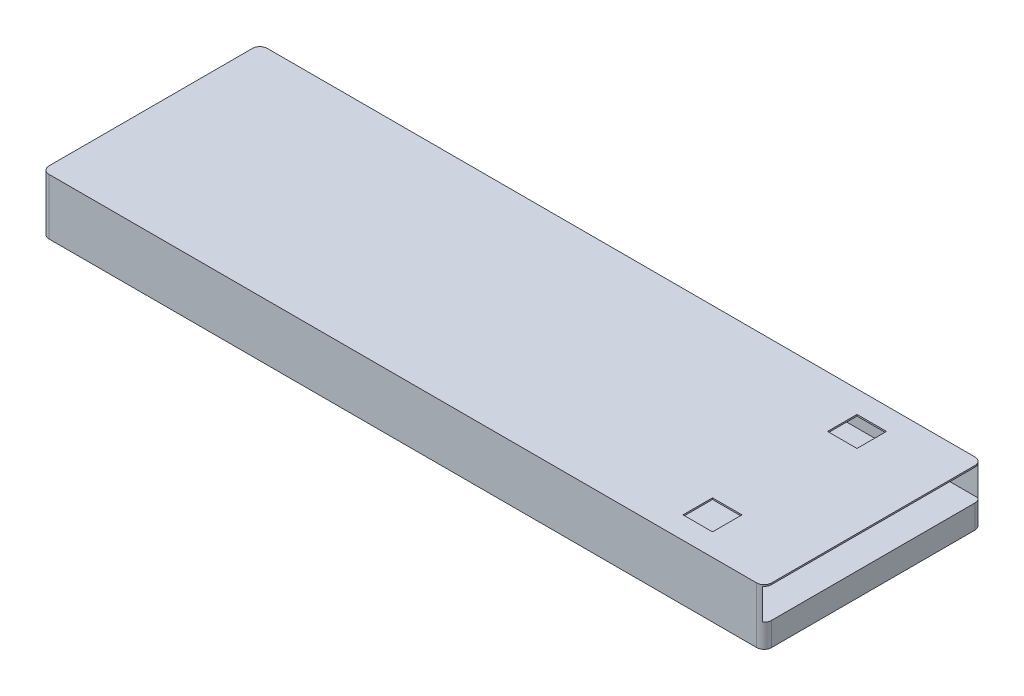
ISO-10303-21;
HEADER;
FILE_DESCRIPTION(('STEP AP214'),'2;1');
FILE_NAME('part.step','',(''),(''),'','','');
FILE_SCHEMA(('AUTOMOTIVE_DESIGN { 1 0 10303 214 1 1 1 1 }'));
ENDSEC;
DATA;
#1=APPLICATION_CONTEXT('core data for automotive mechanical design processes');
#2=APPLICATION_PROTOCOL_DEFINITION('international standard','automotive_design',2000,#1);
#3=PRODUCT_CONTEXT('',#1,'mechanical');
#4=PRODUCT('Part','Part','',(#3));
#5=PRODUCT_RELATED_PRODUCT_CATEGORY('part','',(#4));
#6=PRODUCT_DEFINITION_FORMATION('','',#4);
#7=PRODUCT_DEFINITION_CONTEXT('part definition',#1,'design');
#8=PRODUCT_DEFINITION('design','',#6,#7);
#9=PRODUCT_DEFINITION_SHAPE('','',#8);
#10=(LENGTH_UNIT() NAMED_UNIT(*) SI_UNIT(.MILLI.,.METRE.));
#11=(NAMED_UNIT(*) PLANE_ANGLE_UNIT() SI_UNIT($,.RADIAN.));
#12=(NAMED_UNIT(*) SI_UNIT($,.STERADIAN.) SOLID_ANGLE_UNIT());
#13=UNCERTAINTY_MEASURE_WITH_UNIT(LENGTH_MEASURE(1.E-05),#10,'distance_accuracy_value','');
#14=(GEOMETRIC_REPRESENTATION_CONTEXT(3) GLOBAL_UNCERTAINTY_ASSIGNED_CONTEXT((#13)) GLOBAL_UNIT_ASSIGNED_CONTEXT((#10,
#11,#12)) REPRESENTATION_CONTEXT('',''));
#15=CARTESIAN_POINT('',(0.,0.,0.));
#16=DIRECTION('',(0.,0.,1.));
#17=DIRECTION('',(1.,0.,0.));
#18=AXIS2_PLACEMENT_3D('',#15,#16,#17);
#19=CARTESIAN_POINT('',(0.,-3.8,0.));
#20=DIRECTION('',(0.,1.,0.));
#21=DIRECTION('',(0.,0.,1.));
#22=AXIS2_PLACEMENT_3D('',#19,#20,#21);
#23=PLANE('',#22);
#24=DIRECTION('',(0.,0.,-1.));
#25=VECTOR('',#24,1.);
#26=CARTESIAN_POINT('',(0.,-3.8,0.));
#27=LINE('',#26,#25);
#28=CARTESIAN_POINT('',(0.,-3.8,-0.5));
#29=VERTEX_POINT('',#28);
#30=CARTESIAN_POINT('',(0.,-3.8,-14.3));
#31=VERTEX_POINT('',#30);
#32=EDGE_CURVE('E344',#29,#31,#27,.T.);
#33=ORIENTED_EDGE('',*,*,#32,.F.);
#34=CARTESIAN_POINT('',(-0.5,-3.8,-0.5));
#35=DIRECTION('',(0.,1.,0.));
#36=DIRECTION('',(0.,0.,1.));
#37=AXIS2_PLACEMENT_3D('',#34,#35,#36);
#38=CIRCLE('',#37,0.5);
#39=CARTESIAN_POINT('',(-0.5,-3.8,0.));
#40=VERTEX_POINT('',#39);
#41=EDGE_CURVE('E405',#29,#40,#38,.F.);
#42=ORIENTED_EDGE('',*,*,#41,.T.);
#43=DIRECTION('',(1.,0.,0.));
#44=VECTOR('',#43,1.);
#45=CARTESIAN_POINT('',(0.,-3.8,0.));
#46=LINE('',#45,#44);
#47=CARTESIAN_POINT('',(-48.5,-3.8,0.));
#48=VERTEX_POINT('',#47);
#49=EDGE_CURVE('E354',#48,#40,#46,.T.);
#50=ORIENTED_EDGE('',*,*,#49,.F.);
#51=CARTESIAN_POINT('',(-48.5,-3.8,-0.499999999999994));
#52=DIRECTION('',(0.,1.,0.));
#53=DIRECTION('',(0.,0.,1.));
#54=AXIS2_PLACEMENT_3D('',#51,#52,#53);
#55=CIRCLE('',#54,0.5);
#56=CARTESIAN_POINT('',(-49.,-3.8,-0.499999999999994));
#57=VERTEX_POINT('',#56);
#58=EDGE_CURVE('E399',#48,#57,#55,.F.);
#59=ORIENTED_EDGE('',*,*,#58,.T.);
#60=DIRECTION('',(0.,0.,1.));
#61=VECTOR('',#60,1.);
#62=CARTESIAN_POINT('',(-49.,-3.8,0.));
#63=LINE('',#62,#61);
#64=CARTESIAN_POINT('',(-49.,-3.8,-14.3));
#65=VERTEX_POINT('',#64);
#66=EDGE_CURVE('E351',#65,#57,#63,.T.);
#67=ORIENTED_EDGE('',*,*,#66,.F.);
#68=CARTESIAN_POINT('',(-48.5,-3.8,-14.3));
#69=DIRECTION('',(0.,1.,0.));
#70=DIRECTION('',(0.,0.,1.));
#71=AXIS2_PLACEMENT_3D('',#68,#69,#70);
#72=CIRCLE('',#71,0.5);
#73=CARTESIAN_POINT('',(-48.5,-3.8,-14.8));
#74=VERTEX_POINT('',#73);
#75=EDGE_CURVE('E401',#65,#74,#72,.F.);
#76=ORIENTED_EDGE('',*,*,#75,.T.);
#77=DIRECTION('',(-1.,0.,0.));
#78=VECTOR('',#77,1.);
#79=CARTESIAN_POINT('',(0.,-3.8,-14.8));
#80=LINE('',#79,#78);
#81=CARTESIAN_POINT('',(-0.5,-3.8,-14.8));
#82=VERTEX_POINT('',#81);
#83=EDGE_CURVE('E347',#82,#74,#80,.T.);
#84=ORIENTED_EDGE('',*,*,#83,.F.);
#85=CARTESIAN_POINT('',(-0.5,-3.8,-14.3));
#86=DIRECTION('',(0.,1.,0.));
#87=DIRECTION('',(0.,0.,1.));
#88=AXIS2_PLACEMENT_3D('',#85,#86,#87);
#89=CIRCLE('',#88,0.5);
#90=EDGE_CURVE('E403',#82,#31,#89,.F.);
#91=ORIENTED_EDGE('',*,*,#90,.T.);
#92=EDGE_LOOP('',(#33,#42,#50,#59,#67,#76,#84,#91));
#93=FACE_BOUND('',#92,.T.);
#94=DIRECTION('',(0.,0.,-1.));
#95=VECTOR('',#94,1.);
#96=CARTESIAN_POINT('',(-34.,-3.8,-3.9));
#97=LINE('',#96,#95);
#98=CARTESIAN_POINT('',(-34.,-3.8,-3.9));
#99=VERTEX_POINT('',#98);
#100=CARTESIAN_POINT('',(-34.,-3.8,-10.9));
#101=VERTEX_POINT('',#100);
#102=EDGE_CURVE('E224',#99,#101,#97,.T.);
#103=ORIENTED_EDGE('',*,*,#102,.F.);
#104=DIRECTION('',(-1.,0.,0.));
#105=VECTOR('',#104,1.);
#106=CARTESIAN_POINT('',(-34.,-3.8,-3.9));
#107=LINE('',#106,#105);
#108=CARTESIAN_POINT('',(-25.,-3.8,-3.9));
#109=VERTEX_POINT('',#108);
#110=EDGE_CURVE('E231',#109,#99,#107,.T.);
#111=ORIENTED_EDGE('',*,*,#110,.F.);
#112=DIRECTION('',(0.,0.,1.));
#113=VECTOR('',#112,1.);
#114=CARTESIAN_POINT('',(-25.,-3.8,-3.9));
#115=LINE('',#114,#113);
#116=CARTESIAN_POINT('',(-25.,-3.8,-10.9));
#117=VERTEX_POINT('',#116);
#118=EDGE_CURVE('E242',#117,#109,#115,.T.);
#119=ORIENTED_EDGE('',*,*,#118,.F.);
#120=DIRECTION('',(1.,0.,0.));
#121=VECTOR('',#120,1.);
#122=CARTESIAN_POINT('',(-34.,-3.8,-10.9));
#123=LINE('',#122,#121);
#124=EDGE_CURVE('E239',#101,#117,#123,.T.);
#125=ORIENTED_EDGE('',*,*,#124,.F.);
#126=EDGE_LOOP('',(#103,#111,#119,#125));
#127=FACE_BOUND('',#126,.T.);
#128=ADVANCED_FACE('F35',(#93,#127),#23,.F.);
#129=CARTESIAN_POINT('',(0.,-3.8,0.));
#130=DIRECTION('',(1.,0.,0.));
#131=DIRECTION('',(0.,0.,-1.));
#132=AXIS2_PLACEMENT_3D('',#129,#130,#131);
#133=PLANE('',#132);
#134=DIRECTION('',(0.,0.,-1.));
#135=VECTOR('',#134,1.);
#136=CARTESIAN_POINT('',(0.,0.,0.));
#137=LINE('',#136,#135);
#138=CARTESIAN_POINT('',(0.,0.,-0.5));
#139=VERTEX_POINT('',#138);
#140=CARTESIAN_POINT('',(0.,0.,-14.3));
#141=VERTEX_POINT('',#140);
#142=EDGE_CURVE('E341',#139,#141,#137,.T.);
#143=ORIENTED_EDGE('',*,*,#142,.F.);
#144=DIRECTION('',(0.,1.,0.));
#145=VECTOR('',#144,1.);
#146=CARTESIAN_POINT('',(0.,-3.8,-0.5));
#147=LINE('',#146,#145);
#148=CARTESIAN_POINT('',(0.,-0.100000000000002,-0.5));
#149=VERTEX_POINT('',#148);
#150=EDGE_CURVE('E387',#139,#149,#147,.F.);
#151=ORIENTED_EDGE('',*,*,#150,.T.);
#152=DIRECTION('',(0.,0.,1.));
#153=VECTOR('',#152,1.);
#154=CARTESIAN_POINT('',(0.,-0.1,-14.7));
#155=LINE('',#154,#153);
#156=CARTESIAN_POINT('',(0.,-0.1,-14.3));
#157=VERTEX_POINT('',#156);
#158=EDGE_CURVE('E319',#157,#149,#155,.T.);
#159=ORIENTED_EDGE('',*,*,#158,.F.);
#160=DIRECTION('',(0.,1.,0.));
#161=VECTOR('',#160,1.);
#162=CARTESIAN_POINT('',(0.,-3.8,-14.3));
#163=LINE('',#162,#161);
#164=EDGE_CURVE('E380',#157,#141,#163,.T.);
#165=ORIENTED_EDGE('',*,*,#164,.T.);
#166=EDGE_LOOP('',(#143,#151,#159,#165));
#167=FACE_BOUND('',#166,.T.);
#168=ADVANCED_FACE('F465',(#167),#133,.T.);
#169=DIRECTION('',(0.,0.,1.));
#170=VECTOR('',#169,1.);
#171=CARTESIAN_POINT('',(0.,-2.2,-0.0999999999999996));
#172=LINE('',#171,#170);
#173=CARTESIAN_POINT('',(0.,-2.2,-14.3));
#174=VERTEX_POINT('',#173);
#175=CARTESIAN_POINT('',(0.,-2.2,-0.5));
#176=VERTEX_POINT('',#175);
#177=EDGE_CURVE('E316',#174,#176,#172,.T.);
#178=ORIENTED_EDGE('',*,*,#177,.T.);
#179=DIRECTION('',(0.,1.,0.));
#180=VECTOR('',#179,1.);
#181=CARTESIAN_POINT('',(0.,-3.8,-0.5));
#182=LINE('',#181,#180);
#183=EDGE_CURVE('E385',#176,#29,#182,.F.);
#184=ORIENTED_EDGE('',*,*,#183,.T.);
#185=ORIENTED_EDGE('',*,*,#32,.T.);
#186=DIRECTION('',(0.,1.,0.));
#187=VECTOR('',#186,1.);
#188=CARTESIAN_POINT('',(0.,-3.8,-14.3));
#189=LINE('',#188,#187);
#190=EDGE_CURVE('E382',#31,#174,#189,.T.);
#191=ORIENTED_EDGE('',*,*,#190,.T.);
#192=EDGE_LOOP('',(#178,#184,#185,#191));
#193=FACE_BOUND('',#192,.T.);
#194=ADVANCED_FACE('F471',(#193),#133,.T.);
#195=CARTESIAN_POINT('',(0.,-3.8,0.));
#196=DIRECTION('',(0.,0.,1.));
#197=DIRECTION('',(1.,0.,0.));
#198=AXIS2_PLACEMENT_3D('',#195,#196,#197);
#199=PLANE('',#198);
#200=ORIENTED_EDGE('',*,*,#49,.T.);
#201=DIRECTION('',(0.,1.,0.));
#202=VECTOR('',#201,1.);
#203=CARTESIAN_POINT('',(-0.5,-3.8,0.));
#204=LINE('',#203,#202);
#205=CARTESIAN_POINT('',(-0.5,0.,0.));
#206=VERTEX_POINT('',#205);
#207=EDGE_CURVE('E369',#40,#206,#204,.T.);
#208=ORIENTED_EDGE('',*,*,#207,.T.);
#209=DIRECTION('',(1.,0.,0.));
#210=VECTOR('',#209,1.);
#211=CARTESIAN_POINT('',(0.,0.,0.));
#212=LINE('',#211,#210);
#213=CARTESIAN_POINT('',(-48.5,0.,0.));
#214=VERTEX_POINT('',#213);
#215=EDGE_CURVE('E348',#214,#206,#212,.T.);
#216=ORIENTED_EDGE('',*,*,#215,.F.);
#217=DIRECTION('',(0.,1.,0.));
#218=VECTOR('',#217,1.);
#219=CARTESIAN_POINT('',(-48.5,-3.8,0.));
#220=LINE('',#219,#218);
#221=EDGE_CURVE('E357',#214,#48,#220,.F.);
#222=ORIENTED_EDGE('',*,*,#221,.T.);
#223=EDGE_LOOP('',(#200,#208,#216,#222));
#224=FACE_BOUND('',#223,.T.);
#225=ADVANCED_FACE('F484',(#224),#199,.T.);
#226=CARTESIAN_POINT('',(-49.,-3.8,0.));
#227=DIRECTION('',(-1.,0.,0.));
#228=DIRECTION('',(0.,0.,1.));
#229=AXIS2_PLACEMENT_3D('',#226,#227,#228);
#230=PLANE('',#229);
#231=DIRECTION('',(0.,0.,1.));
#232=VECTOR('',#231,1.);
#233=CARTESIAN_POINT('',(-49.,0.,0.));
#234=LINE('',#233,#232);
#235=CARTESIAN_POINT('',(-49.,0.,-14.3));
#236=VERTEX_POINT('',#235);
#237=CARTESIAN_POINT('',(-49.,0.,-0.499999999999994));
#238=VERTEX_POINT('',#237);
#239=EDGE_CURVE('E363',#236,#238,#234,.T.);
#240=ORIENTED_EDGE('',*,*,#239,.F.);
#241=DIRECTION('',(0.,1.,0.));
#242=VECTOR('',#241,1.);
#243=CARTESIAN_POINT('',(-49.,-3.8,-14.3));
#244=LINE('',#243,#242);
#245=EDGE_CURVE('E417',#236,#65,#244,.F.);
#246=ORIENTED_EDGE('',*,*,#245,.T.);
#247=ORIENTED_EDGE('',*,*,#66,.T.);
#248=DIRECTION('',(0.,1.,0.));
#249=VECTOR('',#248,1.);
#250=CARTESIAN_POINT('',(-49.,-3.8,-0.499999999999994));
#251=LINE('',#250,#249);
#252=EDGE_CURVE('E414',#57,#238,#251,.T.);
#253=ORIENTED_EDGE('',*,*,#252,.T.);
#254=EDGE_LOOP('',(#240,#246,#247,#253));
#255=FACE_BOUND('',#254,.T.);
#256=ADVANCED_FACE('F487',(#255),#230,.T.);
#257=CARTESIAN_POINT('',(0.,-3.8,-14.8));
#258=DIRECTION('',(0.,0.,-1.));
#259=DIRECTION('',(-1.,0.,0.));
#260=AXIS2_PLACEMENT_3D('',#257,#258,#259);
#261=PLANE('',#260);
#262=DIRECTION('',(-1.,0.,0.));
#263=VECTOR('',#262,1.);
#264=CARTESIAN_POINT('',(0.,0.,-14.8));
#265=LINE('',#264,#263);
#266=CARTESIAN_POINT('',(-0.5,0.,-14.8));
#267=VERTEX_POINT('',#266);
#268=CARTESIAN_POINT('',(-48.5,0.,-14.8));
#269=VERTEX_POINT('',#268);
#270=EDGE_CURVE('E360',#267,#269,#265,.T.);
#271=ORIENTED_EDGE('',*,*,#270,.F.);
#272=DIRECTION('',(0.,1.,0.));
#273=VECTOR('',#272,1.);
#274=CARTESIAN_POINT('',(-0.5,-3.8,-14.8));
#275=LINE('',#274,#273);
#276=EDGE_CURVE('E412',#267,#82,#275,.F.);
#277=ORIENTED_EDGE('',*,*,#276,.T.);
#278=ORIENTED_EDGE('',*,*,#83,.T.);
#279=DIRECTION('',(0.,1.,0.));
#280=VECTOR('',#279,1.);
#281=CARTESIAN_POINT('',(-48.5,-3.8,-14.8));
#282=LINE('',#281,#280);
#283=EDGE_CURVE('E409',#74,#269,#282,.T.);
#284=ORIENTED_EDGE('',*,*,#283,.T.);
#285=EDGE_LOOP('',(#271,#277,#278,#284));
#286=FACE_BOUND('',#285,.T.);
#287=ADVANCED_FACE('F482',(#286),#261,.T.);
#288=CARTESIAN_POINT('',(0.,0.,0.));
#289=DIRECTION('',(0.,1.,0.));
#290=DIRECTION('',(0.,0.,1.));
#291=AXIS2_PLACEMENT_3D('',#288,#289,#290);
#292=PLANE('',#291);
#293=DIRECTION('',(0.,0.,-1.));
#294=VECTOR('',#293,1.);
#295=CARTESIAN_POINT('',(-5.,0.,-13.3));
#296=LINE('',#295,#294);
#297=CARTESIAN_POINT('',(-5.,0.,-11.3));
#298=VERTEX_POINT('',#297);
#299=CARTESIAN_POINT('',(-5.,0.,-13.3));
#300=VERTEX_POINT('',#299);
#301=EDGE_CURVE('E253',#298,#300,#296,.T.);
#302=ORIENTED_EDGE('',*,*,#301,.F.);
#303=DIRECTION('',(1.,0.,0.));
#304=VECTOR('',#303,1.);
#305=CARTESIAN_POINT('',(-5.,0.,-11.3));
#306=LINE('',#305,#304);
#307=CARTESIAN_POINT('',(-7.,0.,-11.3));
#308=VERTEX_POINT('',#307);
#309=EDGE_CURVE('E262',#308,#298,#306,.T.);
#310=ORIENTED_EDGE('',*,*,#309,.F.);
#311=DIRECTION('',(0.,0.,1.));
#312=VECTOR('',#311,1.);
#313=CARTESIAN_POINT('',(-7.,0.,-13.3));
#314=LINE('',#313,#312);
#315=CARTESIAN_POINT('',(-7.,0.,-13.3));
#316=VERTEX_POINT('',#315);
#317=EDGE_CURVE('E259',#316,#308,#314,.T.);
#318=ORIENTED_EDGE('',*,*,#317,.F.);
#319=DIRECTION('',(-1.,0.,0.));
#320=VECTOR('',#319,1.);
#321=CARTESIAN_POINT('',(-5.,0.,-13.3));
#322=LINE('',#321,#320);
#323=EDGE_CURVE('E255',#300,#316,#322,.T.);
#324=ORIENTED_EDGE('',*,*,#323,.F.);
#325=EDGE_LOOP('',(#302,#310,#318,#324));
#326=FACE_BOUND('',#325,.T.);
#327=DIRECTION('',(0.,0.,-1.));
#328=VECTOR('',#327,1.);
#329=CARTESIAN_POINT('',(-5.,0.,-3.5));
#330=LINE('',#329,#328);
#331=CARTESIAN_POINT('',(-5.,0.,-1.5));
#332=VERTEX_POINT('',#331);
#333=CARTESIAN_POINT('',(-5.,0.,-3.5));
#334=VERTEX_POINT('',#333);
#335=EDGE_CURVE('E252',#332,#334,#330,.T.);
#336=ORIENTED_EDGE('',*,*,#335,.F.);
#337=DIRECTION('',(1.,0.,0.));
#338=VECTOR('',#337,1.);
#339=CARTESIAN_POINT('',(-5.,0.,-1.5));
#340=LINE('',#339,#338);
#341=CARTESIAN_POINT('',(-7.,0.,-1.5));
#342=VERTEX_POINT('',#341);
#343=EDGE_CURVE('E282',#342,#332,#340,.T.);
#344=ORIENTED_EDGE('',*,*,#343,.F.);
#345=DIRECTION('',(0.,0.,1.));
#346=VECTOR('',#345,1.);
#347=CARTESIAN_POINT('',(-7.,0.,-3.5));
#348=LINE('',#347,#346);
#349=CARTESIAN_POINT('',(-7.,0.,-3.5));
#350=VERTEX_POINT('',#349);
#351=EDGE_CURVE('E279',#350,#342,#348,.T.);
#352=ORIENTED_EDGE('',*,*,#351,.F.);
#353=DIRECTION('',(-1.,0.,0.));
#354=VECTOR('',#353,1.);
#355=CARTESIAN_POINT('',(-5.,0.,-3.5));
#356=LINE('',#355,#354);
#357=EDGE_CURVE('E276',#334,#350,#356,.T.);
#358=ORIENTED_EDGE('',*,*,#357,.F.);
#359=EDGE_LOOP('',(#336,#344,#352,#358));
#360=FACE_BOUND('',#359,.T.);
#361=ORIENTED_EDGE('',*,*,#215,.T.);
#362=CARTESIAN_POINT('',(-0.5,0.,-0.5));
#363=DIRECTION('',(0.,1.,0.));
#364=DIRECTION('',(0.,0.,1.));
#365=AXIS2_PLACEMENT_3D('',#362,#363,#364);
#366=CIRCLE('',#365,0.5);
#367=EDGE_CURVE('E378',#206,#139,#366,.T.);
#368=ORIENTED_EDGE('',*,*,#367,.T.);
#369=ORIENTED_EDGE('',*,*,#142,.T.);
#370=CARTESIAN_POINT('',(-0.5,0.,-14.3));
#371=DIRECTION('',(0.,1.,0.));
#372=DIRECTION('',(0.,0.,1.));
#373=AXIS2_PLACEMENT_3D('',#370,#371,#372);
#374=CIRCLE('',#373,0.5);
#375=EDGE_CURVE('E376',#141,#267,#374,.T.);
#376=ORIENTED_EDGE('',*,*,#375,.T.);
#377=ORIENTED_EDGE('',*,*,#270,.T.);
#378=CARTESIAN_POINT('',(-48.5,0.,-14.3));
#379=DIRECTION('',(0.,1.,0.));
#380=DIRECTION('',(0.,0.,1.));
#381=AXIS2_PLACEMENT_3D('',#378,#379,#380);
#382=CIRCLE('',#381,0.5);
#383=EDGE_CURVE('E374',#269,#236,#382,.T.);
#384=ORIENTED_EDGE('',*,*,#383,.T.);
#385=ORIENTED_EDGE('',*,*,#239,.T.);
#386=CARTESIAN_POINT('',(-48.5,0.,-0.499999999999994));
#387=DIRECTION('',(0.,1.,0.));
#388=DIRECTION('',(0.,0.,1.));
#389=AXIS2_PLACEMENT_3D('',#386,#387,#388);
#390=CIRCLE('',#389,0.5);
#391=EDGE_CURVE('E372',#238,#214,#390,.T.);
#392=ORIENTED_EDGE('',*,*,#391,.T.);
#393=EDGE_LOOP('',(#361,#368,#369,#376,#377,#384,#385,#392));
#394=FACE_BOUND('',#393,.T.);
#395=ADVANCED_FACE('F479',(#326,#360,#394),#292,.T.);
#396=CARTESIAN_POINT('',(-48.,-0.100000000000002,-0.0999999999999994));
#397=DIRECTION('',(0.,0.,1.));
#398=DIRECTION('',(0.,-1.,0.));
#399=AXIS2_PLACEMENT_3D('',#396,#397,#398);
#400=PLANE('',#399);
#401=DIRECTION('',(1.,0.,0.));
#402=VECTOR('',#401,1.);
#403=CARTESIAN_POINT('',(-48.,-0.100000000000002,-0.0999999999999994));
#404=LINE('',#403,#402);
#405=CARTESIAN_POINT('',(-48.,-0.100000000000002,-0.0999999999999994));
#406=VERTEX_POINT('',#405);
#407=CARTESIAN_POINT('',(-0.199999999999999,-0.100000000000002,-0.0999999999999994));
#408=VERTEX_POINT('',#407);
#409=EDGE_CURVE('E338',#406,#408,#404,.T.);
#410=ORIENTED_EDGE('',*,*,#409,.T.);
#411=DIRECTION('',(0.,1.,0.));
#412=VECTOR('',#411,1.);
#413=CARTESIAN_POINT('',(-0.200000000000001,-0.100000000000002,-0.0999999999999994));
#414=LINE('',#413,#412);
#415=CARTESIAN_POINT('',(-0.2,-2.2,-0.0999999999999996));
#416=VERTEX_POINT('',#415);
#417=EDGE_CURVE('E393',#408,#416,#414,.F.);
#418=ORIENTED_EDGE('',*,*,#417,.T.);
#419=DIRECTION('',(1.,0.,0.));
#420=VECTOR('',#419,1.);
#421=CARTESIAN_POINT('',(-62.6768525236169,-2.2,-0.0999999999999996));
#422=LINE('',#421,#420);
#423=CARTESIAN_POINT('',(-48.,-2.2,-0.0999999999999996));
#424=VERTEX_POINT('',#423);
#425=EDGE_CURVE('E320',#424,#416,#422,.T.);
#426=ORIENTED_EDGE('',*,*,#425,.F.);
#427=DIRECTION('',(0.,-1.,0.));
#428=VECTOR('',#427,1.);
#429=CARTESIAN_POINT('',(-48.,-0.100000000000002,-0.0999999999999994));
#430=LINE('',#429,#428);
#431=EDGE_CURVE('E328',#406,#424,#430,.T.);
#432=ORIENTED_EDGE('',*,*,#431,.F.);
#433=EDGE_LOOP('',(#410,#418,#426,#432));
#434=FACE_BOUND('',#433,.T.);
#435=ADVANCED_FACE('F477',(#434),#400,.F.);
#436=CARTESIAN_POINT('',(-48.,-0.1,-14.7));
#437=DIRECTION('',(0.,1.,0.));
#438=DIRECTION('',(0.,0.,1.));
#439=AXIS2_PLACEMENT_3D('',#436,#437,#438);
#440=PLANE('',#439);
#441=DIRECTION('',(1.,0.,0.));
#442=VECTOR('',#441,1.);
#443=CARTESIAN_POINT('',(-48.,-0.1,-11.3));
#444=LINE('',#443,#442);
#445=CARTESIAN_POINT('',(-7.,-0.1,-11.3));
#446=VERTEX_POINT('',#445);
#447=CARTESIAN_POINT('',(-5.,-0.1,-11.3));
#448=VERTEX_POINT('',#447);
#449=EDGE_CURVE('E310',#446,#448,#444,.T.);
#450=ORIENTED_EDGE('',*,*,#449,.T.);
#451=DIRECTION('',(0.,0.,-1.));
#452=VECTOR('',#451,1.);
#453=CARTESIAN_POINT('',(-5.,-0.1,-14.7));
#454=LINE('',#453,#452);
#455=CARTESIAN_POINT('',(-5.,-0.1,-13.3));
#456=VERTEX_POINT('',#455);
#457=EDGE_CURVE('E313',#448,#456,#454,.T.);
#458=ORIENTED_EDGE('',*,*,#457,.T.);
#459=DIRECTION('',(-1.,0.,0.));
#460=VECTOR('',#459,1.);
#461=CARTESIAN_POINT('',(-48.,-0.1,-13.3));
#462=LINE('',#461,#460);
#463=CARTESIAN_POINT('',(-7.,-0.1,-13.3));
#464=VERTEX_POINT('',#463);
#465=EDGE_CURVE('E304',#456,#464,#462,.T.);
#466=ORIENTED_EDGE('',*,*,#465,.T.);
#467=DIRECTION('',(0.,0.,1.));
#468=VECTOR('',#467,1.);
#469=CARTESIAN_POINT('',(-7.,-0.1,-14.7));
#470=LINE('',#469,#468);
#471=EDGE_CURVE('E307',#464,#446,#470,.T.);
#472=ORIENTED_EDGE('',*,*,#471,.T.);
#473=EDGE_LOOP('',(#450,#458,#466,#472));
#474=FACE_BOUND('',#473,.T.);
#475=DIRECTION('',(1.,0.,0.));
#476=VECTOR('',#475,1.);
#477=CARTESIAN_POINT('',(-48.,-0.100000000000002,-1.49999999999999));
#478=LINE('',#477,#476);
#479=CARTESIAN_POINT('',(-7.,-0.100000000000001,-1.5));
#480=VERTEX_POINT('',#479);
#481=CARTESIAN_POINT('',(-5.,-0.100000000000002,-1.5));
#482=VERTEX_POINT('',#481);
#483=EDGE_CURVE('E298',#480,#482,#478,.T.);
#484=ORIENTED_EDGE('',*,*,#483,.T.);
#485=DIRECTION('',(0.,0.,-1.));
#486=VECTOR('',#485,1.);
#487=CARTESIAN_POINT('',(-5.,-0.1,-14.7));
#488=LINE('',#487,#486);
#489=CARTESIAN_POINT('',(-5.,-0.100000000000001,-3.5));
#490=VERTEX_POINT('',#489);
#491=EDGE_CURVE('E301',#482,#490,#488,.T.);
#492=ORIENTED_EDGE('',*,*,#491,.T.);
#493=DIRECTION('',(-1.,0.,0.));
#494=VECTOR('',#493,1.);
#495=CARTESIAN_POINT('',(-48.,-0.100000000000001,-3.49999999999998));
#496=LINE('',#495,#494);
#497=CARTESIAN_POINT('',(-7.,-0.100000000000001,-3.5));
#498=VERTEX_POINT('',#497);
#499=EDGE_CURVE('E268',#490,#498,#496,.T.);
#500=ORIENTED_EDGE('',*,*,#499,.T.);
#501=DIRECTION('',(0.,0.,1.));
#502=VECTOR('',#501,1.);
#503=CARTESIAN_POINT('',(-7.00000000000001,-0.1,-14.7));
#504=LINE('',#503,#502);
#505=EDGE_CURVE('E295',#498,#480,#504,.T.);
#506=ORIENTED_EDGE('',*,*,#505,.T.);
#507=EDGE_LOOP('',(#484,#492,#500,#506));
#508=FACE_BOUND('',#507,.T.);
#509=ORIENTED_EDGE('',*,*,#158,.T.);
#510=CARTESIAN_POINT('',(-0.5,-0.100000000000002,-0.5));
#511=DIRECTION('',(0.,1.,0.));
#512=DIRECTION('',(0.,0.,1.));
#513=AXIS2_PLACEMENT_3D('',#510,#511,#512);
#514=CIRCLE('',#513,0.5);
#515=EDGE_CURVE('E391',#149,#408,#514,.F.);
#516=ORIENTED_EDGE('',*,*,#515,.T.);
#517=ORIENTED_EDGE('',*,*,#409,.F.);
#518=DIRECTION('',(0.,0.,1.));
#519=VECTOR('',#518,1.);
#520=CARTESIAN_POINT('',(-48.,-0.1,-14.7));
#521=LINE('',#520,#519);
#522=CARTESIAN_POINT('',(-48.,-0.1,-14.7));
#523=VERTEX_POINT('',#522);
#524=EDGE_CURVE('E332',#523,#406,#521,.T.);
#525=ORIENTED_EDGE('',*,*,#524,.F.);
#526=DIRECTION('',(1.,0.,0.));
#527=VECTOR('',#526,1.);
#528=CARTESIAN_POINT('',(-48.,-0.1,-14.7));
#529=LINE('',#528,#527);
#530=CARTESIAN_POINT('',(-0.200000000000001,-0.0999999999999998,-14.7));
#531=VERTEX_POINT('',#530);
#532=EDGE_CURVE('E335',#523,#531,#529,.T.);
#533=ORIENTED_EDGE('',*,*,#532,.T.);
#534=CARTESIAN_POINT('',(-0.5,-0.0999999999999998,-14.3));
#535=DIRECTION('',(0.,1.,0.));
#536=DIRECTION('',(0.,0.,1.));
#537=AXIS2_PLACEMENT_3D('',#534,#535,#536);
#538=CIRCLE('',#537,0.5);
#539=EDGE_CURVE('E389',#531,#157,#538,.F.);
#540=ORIENTED_EDGE('',*,*,#539,.T.);
#541=EDGE_LOOP('',(#509,#516,#517,#525,#533,#540));
#542=FACE_BOUND('',#541,.T.);
#543=ADVANCED_FACE('F602',(#474,#508,#542),#440,.F.);
#544=CARTESIAN_POINT('',(-48.,-3.7,-14.7));
#545=DIRECTION('',(0.,0.,-1.));
#546=DIRECTION('',(-1.,0.,0.));
#547=AXIS2_PLACEMENT_3D('',#544,#545,#546);
#548=PLANE('',#547);
#549=DIRECTION('',(1.,0.,0.));
#550=VECTOR('',#549,1.);
#551=CARTESIAN_POINT('',(-62.6768525236169,-2.2,-14.7));
#552=LINE('',#551,#550);
#553=CARTESIAN_POINT('',(-48.,-2.2,-14.7));
#554=VERTEX_POINT('',#553);
#555=CARTESIAN_POINT('',(-0.199999999999999,-2.2,-14.7));
#556=VERTEX_POINT('',#555);
#557=EDGE_CURVE('E323',#554,#556,#552,.T.);
#558=ORIENTED_EDGE('',*,*,#557,.T.);
#559=DIRECTION('',(0.,1.,0.));
#560=VECTOR('',#559,1.);
#561=CARTESIAN_POINT('',(-0.200000000000002,-2.2,-14.7));
#562=LINE('',#561,#560);
#563=EDGE_CURVE('E407',#556,#531,#562,.T.);
#564=ORIENTED_EDGE('',*,*,#563,.T.);
#565=ORIENTED_EDGE('',*,*,#532,.F.);
#566=DIRECTION('',(0.,1.,0.));
#567=VECTOR('',#566,1.);
#568=CARTESIAN_POINT('',(-48.,-3.7,-14.7));
#569=LINE('',#568,#567);
#570=EDGE_CURVE('E330',#554,#523,#569,.T.);
#571=ORIENTED_EDGE('',*,*,#570,.F.);
#572=EDGE_LOOP('',(#558,#564,#565,#571));
#573=FACE_BOUND('',#572,.T.);
#574=ADVANCED_FACE('F597',(#573),#548,.F.);
#575=CARTESIAN_POINT('',(-48.,0.,0.));
#576=DIRECTION('',(1.,0.,0.));
#577=DIRECTION('',(0.,0.,-1.));
#578=AXIS2_PLACEMENT_3D('',#575,#576,#577);
#579=PLANE('',#578);
#580=DIRECTION('',(0.,0.,-1.));
#581=VECTOR('',#580,1.);
#582=CARTESIAN_POINT('',(-48.,-2.2,-0.0999999999999996));
#583=LINE('',#582,#581);
#584=EDGE_CURVE('E317',#424,#554,#583,.T.);
#585=ORIENTED_EDGE('',*,*,#584,.T.);
#586=ORIENTED_EDGE('',*,*,#570,.T.);
#587=ORIENTED_EDGE('',*,*,#524,.T.);
#588=ORIENTED_EDGE('',*,*,#431,.T.);
#589=EDGE_LOOP('',(#585,#586,#587,#588));
#590=FACE_BOUND('',#589,.T.);
#591=ADVANCED_FACE('F587',(#590),#579,.T.);
#592=CARTESIAN_POINT('',(-62.6768525236169,-2.2,-0.0999999999999996));
#593=DIRECTION('',(0.,1.,0.));
#594=DIRECTION('',(-1.,0.,0.));
#595=AXIS2_PLACEMENT_3D('',#592,#593,#594);
#596=PLANE('',#595);
#597=ORIENTED_EDGE('',*,*,#425,.T.);
#598=CARTESIAN_POINT('',(-0.5,-2.2,-0.5));
#599=DIRECTION('',(0.,1.,0.));
#600=DIRECTION('',(-1.,0.,0.));
#601=AXIS2_PLACEMENT_3D('',#598,#599,#600);
#602=CIRCLE('',#601,0.5);
#603=EDGE_CURVE('E397',#416,#176,#602,.T.);
#604=ORIENTED_EDGE('',*,*,#603,.T.);
#605=ORIENTED_EDGE('',*,*,#177,.F.);
#606=CARTESIAN_POINT('',(-0.5,-2.2,-14.3));
#607=DIRECTION('',(0.,1.,0.));
#608=DIRECTION('',(-1.,0.,0.));
#609=AXIS2_PLACEMENT_3D('',#606,#607,#608);
#610=CIRCLE('',#609,0.5);
#611=EDGE_CURVE('E395',#174,#556,#610,.T.);
#612=ORIENTED_EDGE('',*,*,#611,.T.);
#613=ORIENTED_EDGE('',*,*,#557,.F.);
#614=ORIENTED_EDGE('',*,*,#584,.F.);
#615=EDGE_LOOP('',(#597,#604,#605,#612,#613,#614));
#616=FACE_BOUND('',#615,.T.);
#617=ADVANCED_FACE('F581',(#616),#596,.T.);
#618=CARTESIAN_POINT('',(-5.,-5.02842712474619,-3.5));
#619=DIRECTION('',(1.,0.,0.));
#620=DIRECTION('',(0.,0.,-1.));
#621=AXIS2_PLACEMENT_3D('',#618,#619,#620);
#622=PLANE('',#621);
#623=DIRECTION('',(0.,1.,0.));
#624=VECTOR('',#623,1.);
#625=CARTESIAN_POINT('',(-5.,-5.02842712474619,-1.5));
#626=LINE('',#625,#624);
#627=EDGE_CURVE('E256',#482,#332,#626,.T.);
#628=ORIENTED_EDGE('',*,*,#627,.T.);
#629=ORIENTED_EDGE('',*,*,#335,.T.);
#630=DIRECTION('',(0.,1.,0.));
#631=VECTOR('',#630,1.);
#632=CARTESIAN_POINT('',(-5.,-5.02842712474619,-3.5));
#633=LINE('',#632,#631);
#634=EDGE_CURVE('E285',#490,#334,#633,.T.);
#635=ORIENTED_EDGE('',*,*,#634,.F.);
#636=ORIENTED_EDGE('',*,*,#491,.F.);
#637=EDGE_LOOP('',(#628,#629,#635,#636));
#638=FACE_BOUND('',#637,.T.);
#639=ADVANCED_FACE('F586',(#638),#622,.F.);
#640=CARTESIAN_POINT('',(-5.,-5.02842712474619,-1.5));
#641=DIRECTION('',(0.,0.,1.));
#642=DIRECTION('',(1.,0.,0.));
#643=AXIS2_PLACEMENT_3D('',#640,#641,#642);
#644=PLANE('',#643);
#645=DIRECTION('',(0.,1.,0.));
#646=VECTOR('',#645,1.);
#647=CARTESIAN_POINT('',(-7.,-5.02842712474619,-1.5));
#648=LINE('',#647,#646);
#649=EDGE_CURVE('E287',#480,#342,#648,.T.);
#650=ORIENTED_EDGE('',*,*,#649,.T.);
#651=ORIENTED_EDGE('',*,*,#343,.T.);
#652=ORIENTED_EDGE('',*,*,#627,.F.);
#653=ORIENTED_EDGE('',*,*,#483,.F.);
#654=EDGE_LOOP('',(#650,#651,#652,#653));
#655=FACE_BOUND('',#654,.T.);
#656=ADVANCED_FACE('F714',(#655),#644,.F.);
#657=CARTESIAN_POINT('',(-7.,-5.02842712474619,-3.5));
#658=DIRECTION('',(-1.,0.,0.));
#659=DIRECTION('',(0.,0.,1.));
#660=AXIS2_PLACEMENT_3D('',#657,#658,#659);
#661=PLANE('',#660);
#662=DIRECTION('',(0.,1.,0.));
#663=VECTOR('',#662,1.);
#664=CARTESIAN_POINT('',(-7.,-5.02842712474619,-3.5));
#665=LINE('',#664,#663);
#666=EDGE_CURVE('E289',#498,#350,#665,.T.);
#667=ORIENTED_EDGE('',*,*,#666,.T.);
#668=ORIENTED_EDGE('',*,*,#351,.T.);
#669=ORIENTED_EDGE('',*,*,#649,.F.);
#670=ORIENTED_EDGE('',*,*,#505,.F.);
#671=EDGE_LOOP('',(#667,#668,#669,#670));
#672=FACE_BOUND('',#671,.T.);
#673=ADVANCED_FACE('F704',(#672),#661,.F.);
#674=CARTESIAN_POINT('',(-5.,-5.02842712474619,-3.5));
#675=DIRECTION('',(0.,0.,-1.));
#676=DIRECTION('',(-1.,0.,0.));
#677=AXIS2_PLACEMENT_3D('',#674,#675,#676);
#678=PLANE('',#677);
#679=ORIENTED_EDGE('',*,*,#634,.T.);
#680=ORIENTED_EDGE('',*,*,#357,.T.);
#681=ORIENTED_EDGE('',*,*,#666,.F.);
#682=ORIENTED_EDGE('',*,*,#499,.F.);
#683=EDGE_LOOP('',(#679,#680,#681,#682));
#684=FACE_BOUND('',#683,.T.);
#685=ADVANCED_FACE('F694',(#684),#678,.F.);
#686=CARTESIAN_POINT('',(-5.,-5.02842712474619,-13.3));
#687=DIRECTION('',(1.,0.,0.));
#688=DIRECTION('',(0.,0.,-1.));
#689=AXIS2_PLACEMENT_3D('',#686,#687,#688);
#690=PLANE('',#689);
#691=DIRECTION('',(0.,1.,0.));
#692=VECTOR('',#691,1.);
#693=CARTESIAN_POINT('',(-5.,-5.02842712474619,-11.3));
#694=LINE('',#693,#692);
#695=EDGE_CURVE('E266',#448,#298,#694,.T.);
#696=ORIENTED_EDGE('',*,*,#695,.T.);
#697=ORIENTED_EDGE('',*,*,#301,.T.);
#698=DIRECTION('',(0.,1.,0.));
#699=VECTOR('',#698,1.);
#700=CARTESIAN_POINT('',(-5.,-5.02842712474619,-13.3));
#701=LINE('',#700,#699);
#702=EDGE_CURVE('E265',#456,#300,#701,.T.);
#703=ORIENTED_EDGE('',*,*,#702,.F.);
#704=ORIENTED_EDGE('',*,*,#457,.F.);
#705=EDGE_LOOP('',(#696,#697,#703,#704));
#706=FACE_BOUND('',#705,.T.);
#707=ADVANCED_FACE('F684',(#706),#690,.F.);
#708=CARTESIAN_POINT('',(-5.,-5.02842712474619,-11.3));
#709=DIRECTION('',(0.,0.,1.));
#710=DIRECTION('',(1.,0.,0.));
#711=AXIS2_PLACEMENT_3D('',#708,#709,#710);
#712=PLANE('',#711);
#713=DIRECTION('',(0.,1.,0.));
#714=VECTOR('',#713,1.);
#715=CARTESIAN_POINT('',(-7.,-5.02842712474619,-11.3));
#716=LINE('',#715,#714);
#717=EDGE_CURVE('E269',#446,#308,#716,.T.);
#718=ORIENTED_EDGE('',*,*,#717,.T.);
#719=ORIENTED_EDGE('',*,*,#309,.T.);
#720=ORIENTED_EDGE('',*,*,#695,.F.);
#721=ORIENTED_EDGE('',*,*,#449,.F.);
#722=EDGE_LOOP('',(#718,#719,#720,#721));
#723=FACE_BOUND('',#722,.T.);
#724=ADVANCED_FACE('F674',(#723),#712,.F.);
#725=CARTESIAN_POINT('',(-7.,-5.02842712474619,-13.3));
#726=DIRECTION('',(-1.,0.,0.));
#727=DIRECTION('',(0.,0.,1.));
#728=AXIS2_PLACEMENT_3D('',#725,#726,#727);
#729=PLANE('',#728);
#730=DIRECTION('',(0.,1.,0.));
#731=VECTOR('',#730,1.);
#732=CARTESIAN_POINT('',(-7.,-5.02842712474619,-13.3));
#733=LINE('',#732,#731);
#734=EDGE_CURVE('E271',#464,#316,#733,.T.);
#735=ORIENTED_EDGE('',*,*,#734,.T.);
#736=ORIENTED_EDGE('',*,*,#317,.T.);
#737=ORIENTED_EDGE('',*,*,#717,.F.);
#738=ORIENTED_EDGE('',*,*,#471,.F.);
#739=EDGE_LOOP('',(#735,#736,#737,#738));
#740=FACE_BOUND('',#739,.T.);
#741=ADVANCED_FACE('F664',(#740),#729,.F.);
#742=CARTESIAN_POINT('',(-5.,-5.02842712474619,-13.3));
#743=DIRECTION('',(0.,0.,-1.));
#744=DIRECTION('',(-1.,0.,0.));
#745=AXIS2_PLACEMENT_3D('',#742,#743,#744);
#746=PLANE('',#745);
#747=ORIENTED_EDGE('',*,*,#702,.T.);
#748=ORIENTED_EDGE('',*,*,#323,.T.);
#749=ORIENTED_EDGE('',*,*,#734,.F.);
#750=ORIENTED_EDGE('',*,*,#465,.F.);
#751=EDGE_LOOP('',(#747,#748,#749,#750));
#752=FACE_BOUND('',#751,.T.);
#753=ADVANCED_FACE('F501',(#752),#746,.F.);
#754=CARTESIAN_POINT('',(-0.5,-3.8,-0.5));
#755=DIRECTION('',(0.,1.,0.));
#756=DIRECTION('',(0.,0.,1.));
#757=AXIS2_PLACEMENT_3D('',#754,#755,#756);
#758=CYLINDRICAL_SURFACE('',#757,0.5);
#759=ORIENTED_EDGE('',*,*,#515,.F.);
#760=ORIENTED_EDGE('',*,*,#150,.F.);
#761=ORIENTED_EDGE('',*,*,#367,.F.);
#762=ORIENTED_EDGE('',*,*,#207,.F.);
#763=ORIENTED_EDGE('',*,*,#41,.F.);
#764=ORIENTED_EDGE('',*,*,#183,.F.);
#765=ORIENTED_EDGE('',*,*,#603,.F.);
#766=ORIENTED_EDGE('',*,*,#417,.F.);
#767=EDGE_LOOP('',(#759,#760,#761,#762,#763,#764,#765,#766));
#768=FACE_BOUND('',#767,.T.);
#769=ADVANCED_FACE('F497',(#768),#758,.T.);
#770=CARTESIAN_POINT('',(-0.5,-3.8,-14.3));
#771=DIRECTION('',(0.,1.,0.));
#772=DIRECTION('',(0.,0.,1.));
#773=AXIS2_PLACEMENT_3D('',#770,#771,#772);
#774=CYLINDRICAL_SURFACE('',#773,0.5);
#775=ORIENTED_EDGE('',*,*,#90,.F.);
#776=ORIENTED_EDGE('',*,*,#276,.F.);
#777=ORIENTED_EDGE('',*,*,#375,.F.);
#778=ORIENTED_EDGE('',*,*,#164,.F.);
#779=ORIENTED_EDGE('',*,*,#539,.F.);
#780=ORIENTED_EDGE('',*,*,#563,.F.);
#781=ORIENTED_EDGE('',*,*,#611,.F.);
#782=ORIENTED_EDGE('',*,*,#190,.F.);
#783=EDGE_LOOP('',(#775,#776,#777,#778,#779,#780,#781,#782));
#784=FACE_BOUND('',#783,.T.);
#785=ADVANCED_FACE('F500',(#784),#774,.T.);
#786=CARTESIAN_POINT('',(-48.5,-3.8,-14.3));
#787=DIRECTION('',(0.,1.,0.));
#788=DIRECTION('',(0.,0.,1.));
#789=AXIS2_PLACEMENT_3D('',#786,#787,#788);
#790=CYLINDRICAL_SURFACE('',#789,0.5);
#791=ORIENTED_EDGE('',*,*,#75,.F.);
#792=ORIENTED_EDGE('',*,*,#245,.F.);
#793=ORIENTED_EDGE('',*,*,#383,.F.);
#794=ORIENTED_EDGE('',*,*,#283,.F.);
#795=EDGE_LOOP('',(#791,#792,#793,#794));
#796=FACE_BOUND('',#795,.T.);
#797=ADVANCED_FACE('F505',(#796),#790,.T.);
#798=CARTESIAN_POINT('',(-48.5,-3.8,-0.499999999999994));
#799=DIRECTION('',(0.,1.,0.));
#800=DIRECTION('',(0.,0.,1.));
#801=AXIS2_PLACEMENT_3D('',#798,#799,#800);
#802=CYLINDRICAL_SURFACE('',#801,0.5);
#803=ORIENTED_EDGE('',*,*,#58,.F.);
#804=ORIENTED_EDGE('',*,*,#221,.F.);
#805=ORIENTED_EDGE('',*,*,#391,.F.);
#806=ORIENTED_EDGE('',*,*,#252,.F.);
#807=EDGE_LOOP('',(#803,#804,#805,#806));
#808=FACE_BOUND('',#807,.T.);
#809=ADVANCED_FACE('F462',(#808),#802,.T.);
#810=CARTESIAN_POINT('',(-34.,-5.5,-3.9));
#811=DIRECTION('',(1.,0.,0.));
#812=DIRECTION('',(0.,0.,-1.));
#813=AXIS2_PLACEMENT_3D('',#810,#811,#812);
#814=PLANE('',#813);
#815=DIRECTION('',(0.,1.,0.));
#816=VECTOR('',#815,1.);
#817=CARTESIAN_POINT('',(-34.,-5.5,-10.9));
#818=LINE('',#817,#816);
#819=CARTESIAN_POINT('',(-34.,-4.5,-10.9));
#820=VERTEX_POINT('',#819);
#821=EDGE_CURVE('E250',#820,#101,#818,.T.);
#822=ORIENTED_EDGE('',*,*,#821,.F.);
#823=DIRECTION('',(0.,0.,-1.));
#824=VECTOR('',#823,1.);
#825=CARTESIAN_POINT('',(-34.,-4.5,-3.9));
#826=LINE('',#825,#824);
#827=CARTESIAN_POINT('',(-34.,-4.5,-3.9));
#828=VERTEX_POINT('',#827);
#829=EDGE_CURVE('E11',#820,#828,#826,.F.);
#830=ORIENTED_EDGE('',*,*,#829,.T.);
#831=DIRECTION('',(0.,1.,0.));
#832=VECTOR('',#831,1.);
#833=CARTESIAN_POINT('',(-34.,-5.5,-3.9));
#834=LINE('',#833,#832);
#835=EDGE_CURVE('E221',#828,#99,#834,.T.);
#836=ORIENTED_EDGE('',*,*,#835,.T.);
#837=ORIENTED_EDGE('',*,*,#102,.T.);
#838=EDGE_LOOP('',(#822,#830,#836,#837));
#839=FACE_BOUND('',#838,.T.);
#840=ADVANCED_FACE('F223',(#839),#814,.F.);
#841=CARTESIAN_POINT('',(-34.,-5.5,-10.9));
#842=DIRECTION('',(0.,0.,1.));
#843=DIRECTION('',(1.,0.,0.));
#844=AXIS2_PLACEMENT_3D('',#841,#842,#843);
#845=PLANE('',#844);
#846=DIRECTION('',(0.,1.,0.));
#847=VECTOR('',#846,1.);
#848=CARTESIAN_POINT('',(-25.,-5.5,-10.9));
#849=LINE('',#848,#847);
#850=CARTESIAN_POINT('',(-25.,-4.5,-10.9));
#851=VERTEX_POINT('',#850);
#852=EDGE_CURVE('E248',#851,#117,#849,.T.);
#853=ORIENTED_EDGE('',*,*,#852,.F.);
#854=DIRECTION('',(1.,0.,0.));
#855=VECTOR('',#854,1.);
#856=CARTESIAN_POINT('',(-34.,-4.5,-10.9));
#857=LINE('',#856,#855);
#858=EDGE_CURVE('E44',#851,#820,#857,.F.);
#859=ORIENTED_EDGE('',*,*,#858,.T.);
#860=ORIENTED_EDGE('',*,*,#821,.T.);
#861=ORIENTED_EDGE('',*,*,#124,.T.);
#862=EDGE_LOOP('',(#853,#859,#860,#861));
#863=FACE_BOUND('',#862,.T.);
#864=ADVANCED_FACE('F454',(#863),#845,.F.);
#865=CARTESIAN_POINT('',(-25.,-5.5,-3.9));
#866=DIRECTION('',(-1.,0.,0.));
#867=DIRECTION('',(0.,0.,1.));
#868=AXIS2_PLACEMENT_3D('',#865,#866,#867);
#869=PLANE('',#868);
#870=DIRECTION('',(0.,1.,0.));
#871=VECTOR('',#870,1.);
#872=CARTESIAN_POINT('',(-25.,-5.5,-3.9));
#873=LINE('',#872,#871);
#874=CARTESIAN_POINT('',(-25.,-4.5,-3.9));
#875=VERTEX_POINT('',#874);
#876=EDGE_CURVE('E230',#875,#109,#873,.T.);
#877=ORIENTED_EDGE('',*,*,#876,.F.);
#878=DIRECTION('',(0.,0.,1.));
#879=VECTOR('',#878,1.);
#880=CARTESIAN_POINT('',(-25.,-4.5,-10.9));
#881=LINE('',#880,#879);
#882=EDGE_CURVE('E59',#875,#851,#881,.F.);
#883=ORIENTED_EDGE('',*,*,#882,.T.);
#884=ORIENTED_EDGE('',*,*,#852,.T.);
#885=ORIENTED_EDGE('',*,*,#118,.T.);
#886=EDGE_LOOP('',(#877,#883,#884,#885));
#887=FACE_BOUND('',#886,.T.);
#888=ADVANCED_FACE('F453',(#887),#869,.F.);
#889=CARTESIAN_POINT('',(-34.,-5.5,-3.9));
#890=DIRECTION('',(0.,0.,-1.));
#891=DIRECTION('',(-1.,0.,0.));
#892=AXIS2_PLACEMENT_3D('',#889,#890,#891);
#893=PLANE('',#892);
#894=ORIENTED_EDGE('',*,*,#835,.F.);
#895=DIRECTION('',(-1.,0.,0.));
#896=VECTOR('',#895,1.);
#897=CARTESIAN_POINT('',(-25.,-4.5,-3.9));
#898=LINE('',#897,#896);
#899=EDGE_CURVE('E428',#828,#875,#898,.F.);
#900=ORIENTED_EDGE('',*,*,#899,.T.);
#901=ORIENTED_EDGE('',*,*,#876,.T.);
#902=ORIENTED_EDGE('',*,*,#110,.T.);
#903=EDGE_LOOP('',(#894,#900,#901,#902));
#904=FACE_BOUND('',#903,.T.);
#905=ADVANCED_FACE('F241',(#904),#893,.F.);
#906=CARTESIAN_POINT('',(0.,-5.5,0.));
#907=DIRECTION('',(0.,-1.,0.));
#908=DIRECTION('',(0.,0.,-1.));
#909=AXIS2_PLACEMENT_3D('',#906,#907,#908);
#910=PLANE('',#909);
#911=DIRECTION('',(0.,0.,1.));
#912=VECTOR('',#911,1.);
#913=CARTESIAN_POINT('',(-26.,-5.5,-3.9));
#914=LINE('',#913,#912);
#915=CARTESIAN_POINT('',(-26.,-5.5,-9.9));
#916=VERTEX_POINT('',#915);
#917=CARTESIAN_POINT('',(-26.,-5.5,-4.9));
#918=VERTEX_POINT('',#917);
#919=EDGE_CURVE('E423',#916,#918,#914,.T.);
#920=ORIENTED_EDGE('',*,*,#919,.T.);
#921=DIRECTION('',(-1.,0.,0.));
#922=VECTOR('',#921,1.);
#923=CARTESIAN_POINT('',(-34.,-5.5,-4.9));
#924=LINE('',#923,#922);
#925=CARTESIAN_POINT('',(-33.,-5.5,-4.9));
#926=VERTEX_POINT('',#925);
#927=EDGE_CURVE('E425',#918,#926,#924,.T.);
#928=ORIENTED_EDGE('',*,*,#927,.T.);
#929=DIRECTION('',(0.,0.,-1.));
#930=VECTOR('',#929,1.);
#931=CARTESIAN_POINT('',(-33.,-5.5,-10.9));
#932=LINE('',#931,#930);
#933=CARTESIAN_POINT('',(-33.,-5.5,-9.9));
#934=VERTEX_POINT('',#933);
#935=EDGE_CURVE('E419',#926,#934,#932,.T.);
#936=ORIENTED_EDGE('',*,*,#935,.T.);
#937=DIRECTION('',(1.,0.,0.));
#938=VECTOR('',#937,1.);
#939=CARTESIAN_POINT('',(-25.,-5.5,-9.9));
#940=LINE('',#939,#938);
#941=EDGE_CURVE('E421',#934,#916,#940,.T.);
#942=ORIENTED_EDGE('',*,*,#941,.T.);
#943=EDGE_LOOP('',(#920,#928,#936,#942));
#944=FACE_BOUND('',#943,.T.);
#945=ADVANCED_FACE('F520',(#944),#910,.T.);
#946=CARTESIAN_POINT('',(0.,-4.5,-9.9));
#947=DIRECTION('',(-1.,0.,0.));
#948=DIRECTION('',(0.,0.,1.));
#949=AXIS2_PLACEMENT_3D('',#946,#947,#948);
#950=CYLINDRICAL_SURFACE('',#949,1.);
#951=CARTESIAN_POINT('',(-33.,-4.5,-9.9));
#952=DIRECTION('',(-0.707106781186547,0.,0.707106781186547));
#953=DIRECTION('',(0.707106781186547,0.,0.707106781186547));
#954=AXIS2_PLACEMENT_3D('',#951,#952,#953);
#955=ELLIPSE('',#954,1.41421356237309,1.);
#956=EDGE_CURVE('E435',#820,#934,#955,.T.);
#957=ORIENTED_EDGE('',*,*,#956,.F.);
#958=ORIENTED_EDGE('',*,*,#858,.F.);
#959=CARTESIAN_POINT('',(-26.,-4.5,-9.9));
#960=DIRECTION('',(-0.707106781186547,0.,-0.707106781186547));
#961=DIRECTION('',(-0.707106781186547,0.,0.707106781186547));
#962=AXIS2_PLACEMENT_3D('',#959,#960,#961);
#963=ELLIPSE('',#962,1.41421356237309,1.);
#964=EDGE_CURVE('E39',#916,#851,#963,.F.);
#965=ORIENTED_EDGE('',*,*,#964,.F.);
#966=ORIENTED_EDGE('',*,*,#941,.F.);
#967=EDGE_LOOP('',(#957,#958,#965,#966));
#968=FACE_BOUND('',#967,.T.);
#969=ADVANCED_FACE('F37',(#968),#950,.T.);
#970=CARTESIAN_POINT('',(-26.,-4.5,0.));
#971=DIRECTION('',(0.,0.,-1.));
#972=DIRECTION('',(-1.,0.,0.));
#973=AXIS2_PLACEMENT_3D('',#970,#971,#972);
#974=CYLINDRICAL_SURFACE('',#973,1.);
#975=ORIENTED_EDGE('',*,*,#964,.T.);
#976=ORIENTED_EDGE('',*,*,#882,.F.);
#977=CARTESIAN_POINT('',(-26.,-4.5,-4.9));
#978=DIRECTION('',(0.707106781186547,0.,-0.707106781186547));
#979=DIRECTION('',(-0.707106781186547,0.,-0.707106781186547));
#980=AXIS2_PLACEMENT_3D('',#977,#978,#979);
#981=ELLIPSE('',#980,1.41421356237309,1.);
#982=EDGE_CURVE('E434',#918,#875,#981,.F.);
#983=ORIENTED_EDGE('',*,*,#982,.F.);
#984=ORIENTED_EDGE('',*,*,#919,.F.);
#985=EDGE_LOOP('',(#975,#976,#983,#984));
#986=FACE_BOUND('',#985,.T.);
#987=ADVANCED_FACE('F444',(#986),#974,.T.);
#988=CARTESIAN_POINT('',(-33.,-4.5,0.));
#989=DIRECTION('',(0.,0.,1.));
#990=DIRECTION('',(1.,0.,0.));
#991=AXIS2_PLACEMENT_3D('',#988,#989,#990);
#992=CYLINDRICAL_SURFACE('',#991,1.);
#993=ORIENTED_EDGE('',*,*,#956,.T.);
#994=ORIENTED_EDGE('',*,*,#935,.F.);
#995=CARTESIAN_POINT('',(-33.,-4.5,-4.9));
#996=DIRECTION('',(0.707106781186547,0.,0.707106781186547));
#997=DIRECTION('',(-0.707106781186547,0.,0.707106781186547));
#998=AXIS2_PLACEMENT_3D('',#995,#996,#997);
#999=ELLIPSE('',#998,1.41421356237309,1.);
#1000=EDGE_CURVE('E432',#828,#926,#999,.T.);
#1001=ORIENTED_EDGE('',*,*,#1000,.F.);
#1002=ORIENTED_EDGE('',*,*,#829,.F.);
#1003=EDGE_LOOP('',(#993,#994,#1001,#1002));
#1004=FACE_BOUND('',#1003,.T.);
#1005=ADVANCED_FACE('F449',(#1004),#992,.T.);
#1006=CARTESIAN_POINT('',(0.,-4.5,-4.9));
#1007=DIRECTION('',(1.,0.,0.));
#1008=DIRECTION('',(0.,0.,-1.));
#1009=AXIS2_PLACEMENT_3D('',#1006,#1007,#1008);
#1010=CYLINDRICAL_SURFACE('',#1009,1.);
#1011=ORIENTED_EDGE('',*,*,#982,.T.);
#1012=ORIENTED_EDGE('',*,*,#899,.F.);
#1013=ORIENTED_EDGE('',*,*,#1000,.T.);
#1014=ORIENTED_EDGE('',*,*,#927,.F.);
#1015=EDGE_LOOP('',(#1011,#1012,#1013,#1014));
#1016=FACE_BOUND('',#1015,.T.);
#1017=ADVANCED_FACE('F452',(#1016),#1010,.T.);
#1018=CLOSED_SHELL('',(#128,#168,#194,#225,#256,#287,#395,#435,#543,#574,#591,#617,#639,#656,
#673,#685,#707,#724,#741,#753,#769,#785,#797,#809,#840,#864,#888,#905,#945,#969,#987,#1005,#1017));
#1019=MANIFOLD_SOLID_BREP('B2',#1018);
#1020=ADVANCED_BREP_SHAPE_REPRESENTATION('',(#18,#1019),#14);
#1021=SHAPE_DEFINITION_REPRESENTATION(#9,#1020);
ENDSEC;
END-ISO-10303-21;
